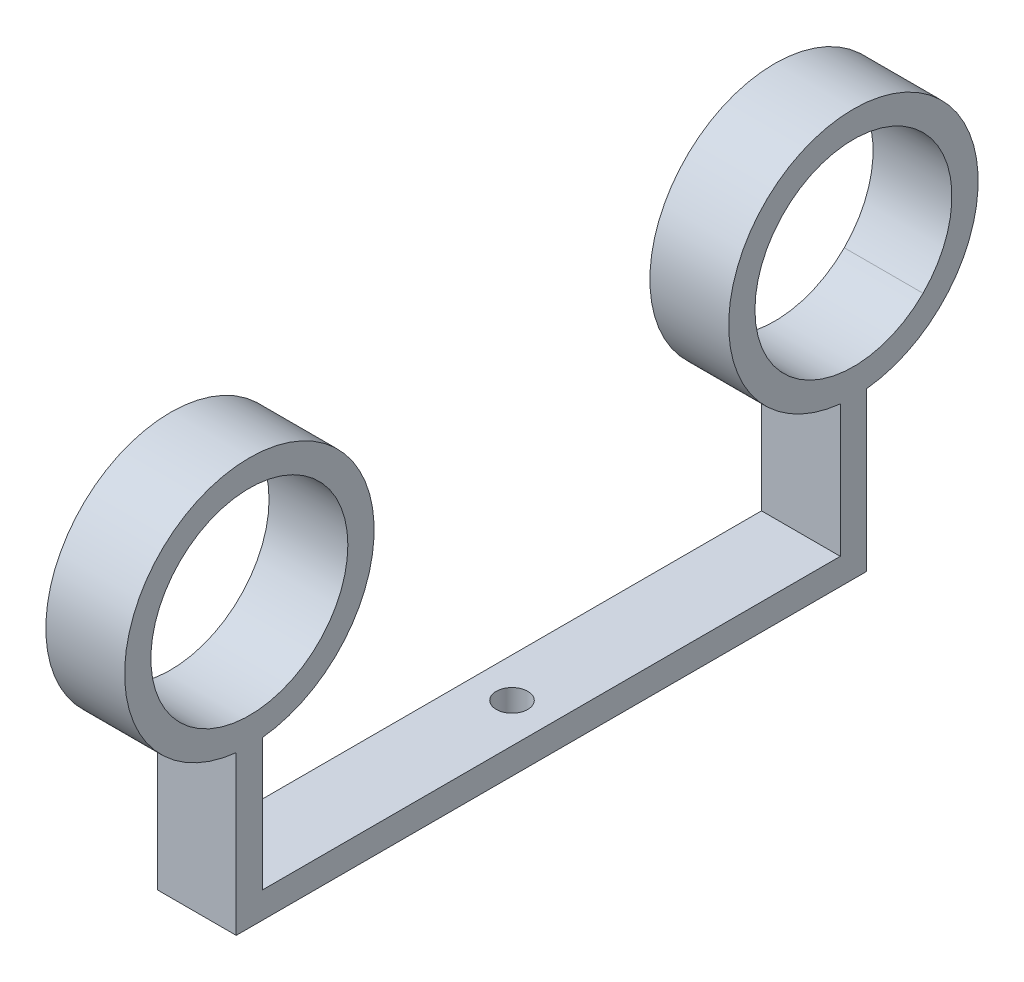
ISO-10303-21;
HEADER;
FILE_DESCRIPTION(('STEP AP214'),'2;1');
FILE_NAME('part.step','',(''),(''),'','','');
FILE_SCHEMA(('AUTOMOTIVE_DESIGN { 1 0 10303 214 1 1 1 1 }'));
ENDSEC;
DATA;
#1=APPLICATION_CONTEXT('core data for automotive mechanical design processes');
#2=APPLICATION_PROTOCOL_DEFINITION('international standard','automotive_design',2000,#1);
#3=PRODUCT_CONTEXT('',#1,'mechanical');
#4=PRODUCT('Part','Part','',(#3));
#5=PRODUCT_RELATED_PRODUCT_CATEGORY('part','',(#4));
#6=PRODUCT_DEFINITION_FORMATION('','',#4);
#7=PRODUCT_DEFINITION_CONTEXT('part definition',#1,'design');
#8=PRODUCT_DEFINITION('design','',#6,#7);
#9=PRODUCT_DEFINITION_SHAPE('','',#8);
#10=(LENGTH_UNIT() NAMED_UNIT(*) SI_UNIT(.MILLI.,.METRE.));
#11=(NAMED_UNIT(*) PLANE_ANGLE_UNIT() SI_UNIT($,.RADIAN.));
#12=(NAMED_UNIT(*) SI_UNIT($,.STERADIAN.) SOLID_ANGLE_UNIT());
#13=UNCERTAINTY_MEASURE_WITH_UNIT(LENGTH_MEASURE(1.E-05),#10,'distance_accuracy_value','');
#14=(GEOMETRIC_REPRESENTATION_CONTEXT(3) GLOBAL_UNCERTAINTY_ASSIGNED_CONTEXT((#13)) GLOBAL_UNIT_ASSIGNED_CONTEXT((#10,
#11,#12)) REPRESENTATION_CONTEXT('',''));
#15=CARTESIAN_POINT('',(0.,0.,0.));
#16=DIRECTION('',(0.,0.,1.));
#17=DIRECTION('',(1.,0.,0.));
#18=AXIS2_PLACEMENT_3D('',#15,#16,#17);
#19=CARTESIAN_POINT('',(-134.350288425444,107.5,115.));
#20=DIRECTION('',(1.,0.,0.));
#21=DIRECTION('',(0.,0.,1.));
#22=AXIS2_PLACEMENT_3D('',#19,#20,#21);
#23=CYLINDRICAL_SURFACE('',#22,37.5);
#24=DIRECTION('',(1.,0.,0.));
#25=VECTOR('',#24,1.);
#26=CARTESIAN_POINT('',(-134.350288425444,80.9834957055044,141.516504294495));
#27=LINE('',#26,#25);
#28=CARTESIAN_POINT('',(30.,80.9834957055044,141.516504294495));
#29=VERTEX_POINT('',#28);
#30=CARTESIAN_POINT('',(0.,80.9834957055044,141.516504294495));
#31=VERTEX_POINT('',#30);
#32=EDGE_CURVE('E13',#29,#31,#27,.F.);
#33=ORIENTED_EDGE('',*,*,#32,.F.);
#34=CARTESIAN_POINT('',(30.,107.5,115.));
#35=DIRECTION('',(-1.,0.,0.));
#36=DIRECTION('',(0.,0.,1.));
#37=AXIS2_PLACEMENT_3D('',#34,#35,#36);
#38=CIRCLE('',#37,37.5);
#39=CARTESIAN_POINT('',(30.,134.016504294496,141.516504294496));
#40=VERTEX_POINT('',#39);
#41=EDGE_CURVE('E164',#40,#29,#38,.T.);
#42=ORIENTED_EDGE('',*,*,#41,.F.);
#43=DIRECTION('',(1.,0.,0.));
#44=VECTOR('',#43,1.);
#45=CARTESIAN_POINT('',(-134.350288425444,134.016504294496,141.516504294496));
#46=LINE('',#45,#44);
#47=CARTESIAN_POINT('',(0.,134.016504294496,141.516504294496));
#48=VERTEX_POINT('',#47);
#49=EDGE_CURVE('E68',#48,#40,#46,.T.);
#50=ORIENTED_EDGE('',*,*,#49,.F.);
#51=CARTESIAN_POINT('',(0.,107.5,115.));
#52=DIRECTION('',(1.,0.,0.));
#53=DIRECTION('',(0.,0.,-1.));
#54=AXIS2_PLACEMENT_3D('',#51,#52,#53);
#55=CIRCLE('',#54,37.5);
#56=EDGE_CURVE('E163',#48,#31,#55,.F.);
#57=ORIENTED_EDGE('',*,*,#56,.T.);
#58=EDGE_LOOP('',(#33,#42,#50,#57));
#59=FACE_BOUND('',#58,.T.);
#60=ADVANCED_FACE('F64',(#59),#23,.F.);
#61=CARTESIAN_POINT('',(-134.350288425444,107.5,-115.));
#62=DIRECTION('',(1.,0.,0.));
#63=DIRECTION('',(0.,0.,-1.));
#64=AXIS2_PLACEMENT_3D('',#61,#62,#63);
#65=CYLINDRICAL_SURFACE('',#64,37.5);
#66=DIRECTION('',(1.,0.,0.));
#67=VECTOR('',#66,1.);
#68=CARTESIAN_POINT('',(-134.350288425444,134.016504294496,-141.516504294496));
#69=LINE('',#68,#67);
#70=CARTESIAN_POINT('',(30.,134.016504294496,-141.516504294496));
#71=VERTEX_POINT('',#70);
#72=CARTESIAN_POINT('',(0.,134.016504294496,-141.516504294496));
#73=VERTEX_POINT('',#72);
#74=EDGE_CURVE('E351',#71,#73,#69,.F.);
#75=ORIENTED_EDGE('',*,*,#74,.F.);
#76=CARTESIAN_POINT('',(30.,107.5,-115.));
#77=DIRECTION('',(1.,0.,0.));
#78=DIRECTION('',(0.,0.,-1.));
#79=AXIS2_PLACEMENT_3D('',#76,#77,#78);
#80=CIRCLE('',#79,37.5);
#81=CARTESIAN_POINT('',(30.,80.9834957055044,-141.516504294495));
#82=VERTEX_POINT('',#81);
#83=EDGE_CURVE('E215',#71,#82,#80,.T.);
#84=ORIENTED_EDGE('',*,*,#83,.T.);
#85=DIRECTION('',(1.,0.,0.));
#86=VECTOR('',#85,1.);
#87=CARTESIAN_POINT('',(-134.350288425444,80.9834957055044,-141.516504294495));
#88=LINE('',#87,#86);
#89=CARTESIAN_POINT('',(0.,80.9834957055044,-141.516504294495));
#90=VERTEX_POINT('',#89);
#91=EDGE_CURVE('E347',#90,#82,#88,.T.);
#92=ORIENTED_EDGE('',*,*,#91,.F.);
#93=CARTESIAN_POINT('',(0.,107.5,-115.));
#94=DIRECTION('',(-1.,0.,0.));
#95=DIRECTION('',(0.,0.,1.));
#96=AXIS2_PLACEMENT_3D('',#93,#94,#95);
#97=CIRCLE('',#96,37.5);
#98=EDGE_CURVE('E214',#73,#90,#97,.F.);
#99=ORIENTED_EDGE('',*,*,#98,.F.);
#100=EDGE_LOOP('',(#75,#84,#92,#99));
#101=FACE_BOUND('',#100,.T.);
#102=ADVANCED_FACE('F300',(#101),#65,.F.);
#103=CARTESIAN_POINT('',(30.,0.,-120.));
#104=DIRECTION('',(0.,0.,1.));
#105=DIRECTION('',(1.,0.,0.));
#106=AXIS2_PLACEMENT_3D('',#103,#104,#105);
#107=PLANE('',#106);
#108=DIRECTION('',(0.,1.,0.));
#109=VECTOR('',#108,1.);
#110=CARTESIAN_POINT('',(0.,0.,-120.));
#111=LINE('',#110,#109);
#112=CARTESIAN_POINT('',(0.,0.,-120.));
#113=VERTEX_POINT('',#112);
#114=CARTESIAN_POINT('',(0.,60.263890930772,-120.));
#115=VERTEX_POINT('',#114);
#116=EDGE_CURVE('E233',#113,#115,#111,.T.);
#117=ORIENTED_EDGE('',*,*,#116,.T.);
#118=DIRECTION('',(1.,0.,0.));
#119=VECTOR('',#118,1.);
#120=CARTESIAN_POINT('',(-134.350288425444,60.263890930772,-120.));
#121=LINE('',#120,#119);
#122=CARTESIAN_POINT('',(30.,60.263890930772,-120.));
#123=VERTEX_POINT('',#122);
#124=EDGE_CURVE('E229',#115,#123,#121,.T.);
#125=ORIENTED_EDGE('',*,*,#124,.T.);
#126=DIRECTION('',(0.,1.,0.));
#127=VECTOR('',#126,1.);
#128=CARTESIAN_POINT('',(30.,0.,-120.));
#129=LINE('',#128,#127);
#130=CARTESIAN_POINT('',(30.,0.,-120.));
#131=VERTEX_POINT('',#130);
#132=EDGE_CURVE('E234',#131,#123,#129,.T.);
#133=ORIENTED_EDGE('',*,*,#132,.F.);
#134=DIRECTION('',(-1.,0.,0.));
#135=VECTOR('',#134,1.);
#136=CARTESIAN_POINT('',(30.,0.,-120.));
#137=LINE('',#136,#135);
#138=EDGE_CURVE('E247',#131,#113,#137,.T.);
#139=ORIENTED_EDGE('',*,*,#138,.T.);
#140=EDGE_LOOP('',(#117,#125,#133,#139));
#141=FACE_BOUND('',#140,.T.);
#142=ADVANCED_FACE('F66',(#141),#107,.F.);
#143=CARTESIAN_POINT('',(30.,0.,-110.));
#144=DIRECTION('',(0.,0.,1.));
#145=DIRECTION('',(1.,0.,0.));
#146=AXIS2_PLACEMENT_3D('',#143,#144,#145);
#147=PLANE('',#146);
#148=DIRECTION('',(1.,0.,0.));
#149=VECTOR('',#148,1.);
#150=CARTESIAN_POINT('',(-134.350288425444,60.263890930772,-110.));
#151=LINE('',#150,#149);
#152=CARTESIAN_POINT('',(0.,60.263890930772,-110.));
#153=VERTEX_POINT('',#152);
#154=CARTESIAN_POINT('',(30.,60.263890930772,-110.));
#155=VERTEX_POINT('',#154);
#156=EDGE_CURVE('E224',#153,#155,#151,.T.);
#157=ORIENTED_EDGE('',*,*,#156,.F.);
#158=DIRECTION('',(0.,1.,0.));
#159=VECTOR('',#158,1.);
#160=CARTESIAN_POINT('',(0.,0.,-110.));
#161=LINE('',#160,#159);
#162=CARTESIAN_POINT('',(0.,10.,-110.));
#163=VERTEX_POINT('',#162);
#164=EDGE_CURVE('E251',#163,#153,#161,.T.);
#165=ORIENTED_EDGE('',*,*,#164,.F.);
#166=DIRECTION('',(-1.,0.,0.));
#167=VECTOR('',#166,1.);
#168=CARTESIAN_POINT('',(30.,10.,-110.));
#169=LINE('',#168,#167);
#170=CARTESIAN_POINT('',(30.,10.,-110.));
#171=VERTEX_POINT('',#170);
#172=EDGE_CURVE('E345',#171,#163,#169,.T.);
#173=ORIENTED_EDGE('',*,*,#172,.F.);
#174=DIRECTION('',(0.,1.,0.));
#175=VECTOR('',#174,1.);
#176=CARTESIAN_POINT('',(30.,0.,-110.));
#177=LINE('',#176,#175);
#178=EDGE_CURVE('E237',#171,#155,#177,.T.);
#179=ORIENTED_EDGE('',*,*,#178,.T.);
#180=EDGE_LOOP('',(#157,#165,#173,#179));
#181=FACE_BOUND('',#180,.T.);
#182=ADVANCED_FACE('F329',(#181),#147,.T.);
#183=CARTESIAN_POINT('',(30.,10.,0.));
#184=DIRECTION('',(0.,1.,0.));
#185=DIRECTION('',(0.,0.,1.));
#186=AXIS2_PLACEMENT_3D('',#183,#184,#185);
#187=PLANE('',#186);
#188=CARTESIAN_POINT('',(15.,10.,0.));
#189=DIRECTION('',(0.,1.,0.));
#190=DIRECTION('',(0.,0.,1.));
#191=AXIS2_PLACEMENT_3D('',#188,#189,#190);
#192=CIRCLE('',#191,6.);
#193=CARTESIAN_POINT('',(15.,10.,6.));
#194=VERTEX_POINT('',#193);
#195=EDGE_CURVE('E267',#194,#194,#192,.T.);
#196=ORIENTED_EDGE('',*,*,#195,.F.);
#197=EDGE_LOOP('',(#196));
#198=FACE_BOUND('',#197,.T.);
#199=DIRECTION('',(0.,0.,-1.));
#200=VECTOR('',#199,1.);
#201=CARTESIAN_POINT('',(0.,10.,0.));
#202=LINE('',#201,#200);
#203=CARTESIAN_POINT('',(0.,10.,110.));
#204=VERTEX_POINT('',#203);
#205=EDGE_CURVE('E255',#204,#163,#202,.T.);
#206=ORIENTED_EDGE('',*,*,#205,.F.);
#207=DIRECTION('',(-1.,0.,0.));
#208=VECTOR('',#207,1.);
#209=CARTESIAN_POINT('',(30.,10.,110.));
#210=LINE('',#209,#208);
#211=CARTESIAN_POINT('',(30.,10.,110.));
#212=VERTEX_POINT('',#211);
#213=EDGE_CURVE('E206',#212,#204,#210,.T.);
#214=ORIENTED_EDGE('',*,*,#213,.F.);
#215=DIRECTION('',(0.,0.,-1.));
#216=VECTOR('',#215,1.);
#217=CARTESIAN_POINT('',(30.,10.,0.));
#218=LINE('',#217,#216);
#219=EDGE_CURVE('E173',#212,#171,#218,.T.);
#220=ORIENTED_EDGE('',*,*,#219,.T.);
#221=ORIENTED_EDGE('',*,*,#172,.T.);
#222=EDGE_LOOP('',(#206,#214,#220,#221));
#223=FACE_BOUND('',#222,.T.);
#224=ADVANCED_FACE('F327',(#198,#223),#187,.T.);
#225=CARTESIAN_POINT('',(30.,0.,0.));
#226=DIRECTION('',(0.,1.,0.));
#227=DIRECTION('',(0.,0.,1.));
#228=AXIS2_PLACEMENT_3D('',#225,#226,#227);
#229=PLANE('',#228);
#230=CARTESIAN_POINT('',(15.,0.,0.));
#231=DIRECTION('',(0.,1.,0.));
#232=DIRECTION('',(0.,0.,1.));
#233=AXIS2_PLACEMENT_3D('',#230,#231,#232);
#234=CIRCLE('',#233,6.);
#235=CARTESIAN_POINT('',(15.,0.,6.));
#236=VERTEX_POINT('',#235);
#237=EDGE_CURVE('E280',#236,#236,#234,.T.);
#238=ORIENTED_EDGE('',*,*,#237,.T.);
#239=EDGE_LOOP('',(#238));
#240=FACE_BOUND('',#239,.T.);
#241=DIRECTION('',(0.,0.,-1.));
#242=VECTOR('',#241,1.);
#243=CARTESIAN_POINT('',(0.,0.,0.));
#244=LINE('',#243,#242);
#245=CARTESIAN_POINT('',(0.,0.,120.));
#246=VERTEX_POINT('',#245);
#247=EDGE_CURVE('E238',#246,#113,#244,.T.);
#248=ORIENTED_EDGE('',*,*,#247,.T.);
#249=ORIENTED_EDGE('',*,*,#138,.F.);
#250=DIRECTION('',(0.,0.,-1.));
#251=VECTOR('',#250,1.);
#252=CARTESIAN_POINT('',(30.,0.,0.));
#253=LINE('',#252,#251);
#254=CARTESIAN_POINT('',(30.,0.,120.));
#255=VERTEX_POINT('',#254);
#256=EDGE_CURVE('E243',#255,#131,#253,.T.);
#257=ORIENTED_EDGE('',*,*,#256,.F.);
#258=DIRECTION('',(-1.,0.,0.));
#259=VECTOR('',#258,1.);
#260=CARTESIAN_POINT('',(30.,0.,120.));
#261=LINE('',#260,#259);
#262=EDGE_CURVE('E178',#255,#246,#261,.T.);
#263=ORIENTED_EDGE('',*,*,#262,.T.);
#264=EDGE_LOOP('',(#248,#249,#257,#263));
#265=FACE_BOUND('',#264,.T.);
#266=ADVANCED_FACE('F287',(#240,#265),#229,.F.);
#267=CARTESIAN_POINT('',(30.,0.,0.));
#268=DIRECTION('',(-1.,0.,0.));
#269=DIRECTION('',(0.,0.,1.));
#270=AXIS2_PLACEMENT_3D('',#267,#268,#269);
#271=PLANE('',#270);
#272=ORIENTED_EDGE('',*,*,#83,.F.);
#273=EDGE_CURVE('E219',#82,#71,#80,.T.);
#274=ORIENTED_EDGE('',*,*,#273,.F.);
#275=EDGE_LOOP('',(#272,#274));
#276=FACE_BOUND('',#275,.T.);
#277=ORIENTED_EDGE('',*,*,#132,.T.);
#278=CARTESIAN_POINT('',(30.,107.5,-115.));
#279=DIRECTION('',(1.,0.,0.));
#280=DIRECTION('',(0.,0.,-1.));
#281=AXIS2_PLACEMENT_3D('',#278,#279,#280);
#282=CIRCLE('',#281,47.5);
#283=EDGE_CURVE('E210',#123,#155,#282,.T.);
#284=ORIENTED_EDGE('',*,*,#283,.T.);
#285=ORIENTED_EDGE('',*,*,#178,.F.);
#286=ORIENTED_EDGE('',*,*,#219,.F.);
#287=DIRECTION('',(0.,1.,0.));
#288=VECTOR('',#287,1.);
#289=CARTESIAN_POINT('',(30.,0.,110.));
#290=LINE('',#289,#288);
#291=CARTESIAN_POINT('',(30.,60.263890930772,110.));
#292=VERTEX_POINT('',#291);
#293=EDGE_CURVE('E167',#212,#292,#290,.T.);
#294=ORIENTED_EDGE('',*,*,#293,.T.);
#295=CARTESIAN_POINT('',(30.,107.5,115.));
#296=DIRECTION('',(-1.,0.,0.));
#297=DIRECTION('',(0.,0.,1.));
#298=AXIS2_PLACEMENT_3D('',#295,#296,#297);
#299=CIRCLE('',#298,47.5);
#300=CARTESIAN_POINT('',(30.,60.263890930772,120.));
#301=VERTEX_POINT('',#300);
#302=EDGE_CURVE('E152',#301,#292,#299,.T.);
#303=ORIENTED_EDGE('',*,*,#302,.F.);
#304=DIRECTION('',(0.,1.,0.));
#305=VECTOR('',#304,1.);
#306=CARTESIAN_POINT('',(30.,0.,120.));
#307=LINE('',#306,#305);
#308=EDGE_CURVE('E179',#255,#301,#307,.T.);
#309=ORIENTED_EDGE('',*,*,#308,.F.);
#310=ORIENTED_EDGE('',*,*,#256,.T.);
#311=EDGE_LOOP('',(#277,#284,#285,#286,#294,#303,#309,#310));
#312=FACE_BOUND('',#311,.T.);
#313=ORIENTED_EDGE('',*,*,#41,.T.);
#314=EDGE_CURVE('E273',#29,#40,#38,.T.);
#315=ORIENTED_EDGE('',*,*,#314,.T.);
#316=EDGE_LOOP('',(#313,#315));
#317=FACE_BOUND('',#316,.T.);
#318=ADVANCED_FACE('F169',(#276,#312,#317),#271,.F.);
#319=CARTESIAN_POINT('',(0.,0.,0.));
#320=DIRECTION('',(-1.,0.,0.));
#321=DIRECTION('',(0.,0.,1.));
#322=AXIS2_PLACEMENT_3D('',#319,#320,#321);
#323=PLANE('',#322);
#324=CARTESIAN_POINT('',(0.,107.5,-115.));
#325=DIRECTION('',(-1.,0.,0.));
#326=DIRECTION('',(0.,0.,1.));
#327=AXIS2_PLACEMENT_3D('',#324,#325,#326);
#328=CIRCLE('',#327,47.5);
#329=EDGE_CURVE('E209',#115,#153,#328,.F.);
#330=ORIENTED_EDGE('',*,*,#329,.F.);
#331=ORIENTED_EDGE('',*,*,#116,.F.);
#332=ORIENTED_EDGE('',*,*,#247,.F.);
#333=DIRECTION('',(0.,1.,0.));
#334=VECTOR('',#333,1.);
#335=CARTESIAN_POINT('',(0.,0.,120.));
#336=LINE('',#335,#334);
#337=CARTESIAN_POINT('',(0.,60.263890930772,120.));
#338=VERTEX_POINT('',#337);
#339=EDGE_CURVE('E190',#246,#338,#336,.T.);
#340=ORIENTED_EDGE('',*,*,#339,.T.);
#341=CARTESIAN_POINT('',(0.,107.5,115.));
#342=DIRECTION('',(1.,0.,0.));
#343=DIRECTION('',(0.,0.,-1.));
#344=AXIS2_PLACEMENT_3D('',#341,#342,#343);
#345=CIRCLE('',#344,47.5);
#346=CARTESIAN_POINT('',(0.,60.263890930772,110.));
#347=VERTEX_POINT('',#346);
#348=EDGE_CURVE('E194',#338,#347,#345,.F.);
#349=ORIENTED_EDGE('',*,*,#348,.T.);
#350=DIRECTION('',(0.,1.,0.));
#351=VECTOR('',#350,1.);
#352=CARTESIAN_POINT('',(0.,0.,110.));
#353=LINE('',#352,#351);
#354=EDGE_CURVE('E184',#204,#347,#353,.T.);
#355=ORIENTED_EDGE('',*,*,#354,.F.);
#356=ORIENTED_EDGE('',*,*,#205,.T.);
#357=ORIENTED_EDGE('',*,*,#164,.T.);
#358=EDGE_LOOP('',(#330,#331,#332,#340,#349,#355,#356,#357));
#359=FACE_BOUND('',#358,.T.);
#360=EDGE_CURVE('E220',#90,#73,#97,.F.);
#361=ORIENTED_EDGE('',*,*,#360,.T.);
#362=ORIENTED_EDGE('',*,*,#98,.T.);
#363=EDGE_LOOP('',(#361,#362));
#364=FACE_BOUND('',#363,.T.);
#365=EDGE_CURVE('E186',#31,#48,#55,.F.);
#366=ORIENTED_EDGE('',*,*,#365,.F.);
#367=ORIENTED_EDGE('',*,*,#56,.F.);
#368=EDGE_LOOP('',(#366,#367));
#369=FACE_BOUND('',#368,.T.);
#370=ADVANCED_FACE('F316',(#359,#364,#369),#323,.T.);
#371=CARTESIAN_POINT('',(-134.350288425444,107.5,-115.));
#372=DIRECTION('',(1.,0.,0.));
#373=DIRECTION('',(0.,0.,-1.));
#374=AXIS2_PLACEMENT_3D('',#371,#372,#373);
#375=CYLINDRICAL_SURFACE('',#374,47.5);
#376=ORIENTED_EDGE('',*,*,#124,.F.);
#377=ORIENTED_EDGE('',*,*,#329,.T.);
#378=ORIENTED_EDGE('',*,*,#156,.T.);
#379=ORIENTED_EDGE('',*,*,#283,.F.);
#380=EDGE_LOOP('',(#376,#377,#378,#379));
#381=FACE_BOUND('',#380,.T.);
#382=ADVANCED_FACE('F314',(#381),#375,.T.);
#383=ORIENTED_EDGE('',*,*,#273,.T.);
#384=ORIENTED_EDGE('',*,*,#74,.T.);
#385=ORIENTED_EDGE('',*,*,#360,.F.);
#386=ORIENTED_EDGE('',*,*,#91,.T.);
#387=EDGE_LOOP('',(#383,#384,#385,#386));
#388=FACE_BOUND('',#387,.T.);
#389=ADVANCED_FACE('F306',(#388),#65,.F.);
#390=CARTESIAN_POINT('',(30.,0.,120.));
#391=DIRECTION('',(0.,0.,-1.));
#392=DIRECTION('',(1.,0.,0.));
#393=AXIS2_PLACEMENT_3D('',#390,#391,#392);
#394=PLANE('',#393);
#395=ORIENTED_EDGE('',*,*,#339,.F.);
#396=ORIENTED_EDGE('',*,*,#262,.F.);
#397=ORIENTED_EDGE('',*,*,#308,.T.);
#398=DIRECTION('',(1.,0.,0.));
#399=VECTOR('',#398,1.);
#400=CARTESIAN_POINT('',(-134.350288425444,60.263890930772,120.));
#401=LINE('',#400,#399);
#402=EDGE_CURVE('E158',#338,#301,#401,.T.);
#403=ORIENTED_EDGE('',*,*,#402,.F.);
#404=EDGE_LOOP('',(#395,#396,#397,#403));
#405=FACE_BOUND('',#404,.T.);
#406=ADVANCED_FACE('F310',(#405),#394,.F.);
#407=CARTESIAN_POINT('',(30.,0.,110.));
#408=DIRECTION('',(0.,0.,-1.));
#409=DIRECTION('',(1.,0.,0.));
#410=AXIS2_PLACEMENT_3D('',#407,#408,#409);
#411=PLANE('',#410);
#412=DIRECTION('',(1.,0.,0.));
#413=VECTOR('',#412,1.);
#414=CARTESIAN_POINT('',(-134.350288425444,60.263890930772,110.));
#415=LINE('',#414,#413);
#416=EDGE_CURVE('E156',#347,#292,#415,.T.);
#417=ORIENTED_EDGE('',*,*,#416,.T.);
#418=ORIENTED_EDGE('',*,*,#293,.F.);
#419=ORIENTED_EDGE('',*,*,#213,.T.);
#420=ORIENTED_EDGE('',*,*,#354,.T.);
#421=EDGE_LOOP('',(#417,#418,#419,#420));
#422=FACE_BOUND('',#421,.T.);
#423=ADVANCED_FACE('F182',(#422),#411,.T.);
#424=CARTESIAN_POINT('',(-134.350288425444,107.5,115.));
#425=DIRECTION('',(1.,0.,0.));
#426=DIRECTION('',(0.,0.,1.));
#427=AXIS2_PLACEMENT_3D('',#424,#425,#426);
#428=CYLINDRICAL_SURFACE('',#427,47.5);
#429=ORIENTED_EDGE('',*,*,#402,.T.);
#430=ORIENTED_EDGE('',*,*,#302,.T.);
#431=ORIENTED_EDGE('',*,*,#416,.F.);
#432=ORIENTED_EDGE('',*,*,#348,.F.);
#433=EDGE_LOOP('',(#429,#430,#431,#432));
#434=FACE_BOUND('',#433,.T.);
#435=ADVANCED_FACE('F154',(#434),#428,.T.);
#436=ORIENTED_EDGE('',*,*,#314,.F.);
#437=ORIENTED_EDGE('',*,*,#32,.T.);
#438=ORIENTED_EDGE('',*,*,#365,.T.);
#439=ORIENTED_EDGE('',*,*,#49,.T.);
#440=EDGE_LOOP('',(#436,#437,#438,#439));
#441=FACE_BOUND('',#440,.T.);
#442=ADVANCED_FACE('F292',(#441),#23,.F.);
#443=CARTESIAN_POINT('',(15.,0.,0.));
#444=DIRECTION('',(0.,1.,0.));
#445=DIRECTION('',(0.,0.,1.));
#446=AXIS2_PLACEMENT_3D('',#443,#444,#445);
#447=CYLINDRICAL_SURFACE('',#446,6.);
#448=ORIENTED_EDGE('',*,*,#195,.T.);
#449=EDGE_LOOP('',(#448));
#450=FACE_BOUND('',#449,.T.);
#451=ORIENTED_EDGE('',*,*,#237,.F.);
#452=EDGE_LOOP('',(#451));
#453=FACE_BOUND('',#452,.T.);
#454=ADVANCED_FACE('F290',(#450,#453),#447,.F.);
#455=CLOSED_SHELL('',(#60,#102,#142,#182,#224,#266,#318,#370,#382,#389,#406,#423,#435,#442,#454));
#456=MANIFOLD_SOLID_BREP('B2',#455);
#457=ADVANCED_BREP_SHAPE_REPRESENTATION('',(#18,#456),#14);
#458=SHAPE_DEFINITION_REPRESENTATION(#9,#457);
ENDSEC;
END-ISO-10303-21;
